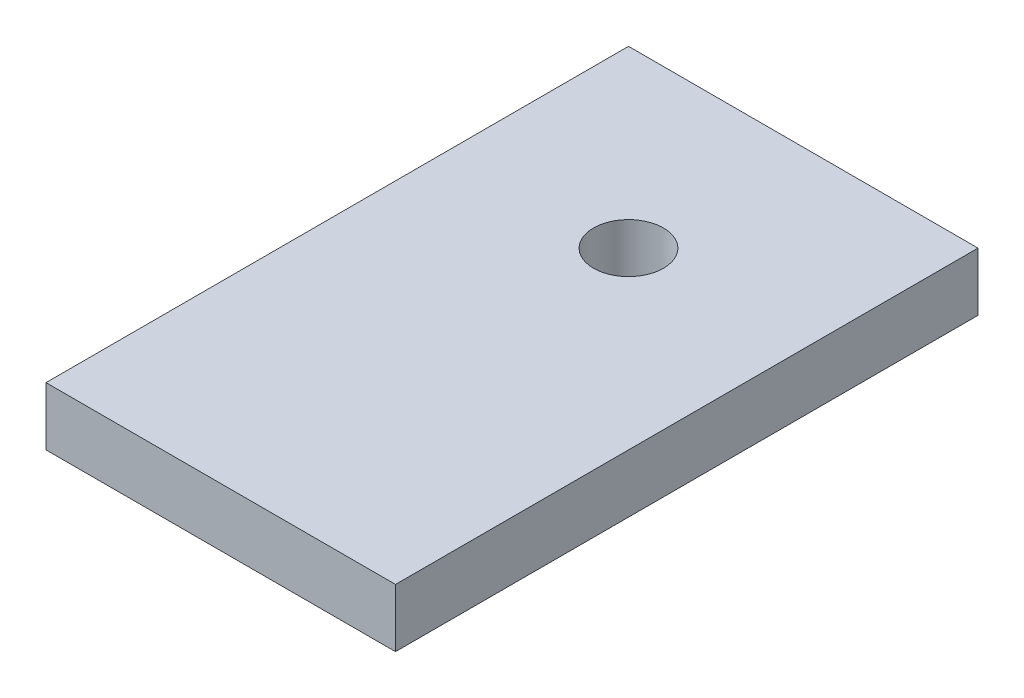
ISO-10303-21;
HEADER;
FILE_DESCRIPTION(('STEP AP214'),'2;1');
FILE_NAME('part.step','',(''),(''),'','','');
FILE_SCHEMA(('AUTOMOTIVE_DESIGN { 1 0 10303 214 1 1 1 1 }'));
ENDSEC;
DATA;
#1=APPLICATION_CONTEXT('core data for automotive mechanical design processes');
#2=APPLICATION_PROTOCOL_DEFINITION('international standard','automotive_design',2000,#1);
#3=PRODUCT_CONTEXT('',#1,'mechanical');
#4=PRODUCT('Part','Part','',(#3));
#5=PRODUCT_RELATED_PRODUCT_CATEGORY('part','',(#4));
#6=PRODUCT_DEFINITION_FORMATION('','',#4);
#7=PRODUCT_DEFINITION_CONTEXT('part definition',#1,'design');
#8=PRODUCT_DEFINITION('design','',#6,#7);
#9=PRODUCT_DEFINITION_SHAPE('','',#8);
#10=(LENGTH_UNIT() NAMED_UNIT(*) SI_UNIT(.MILLI.,.METRE.));
#11=(NAMED_UNIT(*) PLANE_ANGLE_UNIT() SI_UNIT($,.RADIAN.));
#12=(NAMED_UNIT(*) SI_UNIT($,.STERADIAN.) SOLID_ANGLE_UNIT());
#13=UNCERTAINTY_MEASURE_WITH_UNIT(LENGTH_MEASURE(1.E-05),#10,'distance_accuracy_value','');
#14=(GEOMETRIC_REPRESENTATION_CONTEXT(3) GLOBAL_UNCERTAINTY_ASSIGNED_CONTEXT((#13)) GLOBAL_UNIT_ASSIGNED_CONTEXT((#10,
#11,#12)) REPRESENTATION_CONTEXT('',''));
#15=CARTESIAN_POINT('',(0.,0.,0.));
#16=DIRECTION('',(0.,0.,1.));
#17=DIRECTION('',(1.,0.,0.));
#18=AXIS2_PLACEMENT_3D('',#15,#16,#17);
#19=CARTESIAN_POINT('',(-15.,5.,25.));
#20=DIRECTION('',(1.,0.,0.));
#21=DIRECTION('',(0.,0.,-1.));
#22=AXIS2_PLACEMENT_3D('',#19,#20,#21);
#23=PLANE('',#22);
#24=DIRECTION('',(0.,0.,1.));
#25=VECTOR('',#24,1.);
#26=CARTESIAN_POINT('',(-15.,0.,25.));
#27=LINE('',#26,#25);
#28=CARTESIAN_POINT('',(-15.,0.,-25.));
#29=VERTEX_POINT('',#28);
#30=CARTESIAN_POINT('',(-15.,0.,25.));
#31=VERTEX_POINT('',#30);
#32=EDGE_CURVE('E95',#29,#31,#27,.T.);
#33=ORIENTED_EDGE('',*,*,#32,.T.);
#34=DIRECTION('',(0.,-1.,0.));
#35=VECTOR('',#34,1.);
#36=CARTESIAN_POINT('',(-15.,5.,25.));
#37=LINE('',#36,#35);
#38=CARTESIAN_POINT('',(-15.,5.,25.));
#39=VERTEX_POINT('',#38);
#40=EDGE_CURVE('E11',#39,#31,#37,.T.);
#41=ORIENTED_EDGE('',*,*,#40,.F.);
#42=DIRECTION('',(0.,0.,1.));
#43=VECTOR('',#42,1.);
#44=CARTESIAN_POINT('',(-15.,5.,25.));
#45=LINE('',#44,#43);
#46=CARTESIAN_POINT('',(-15.,5.,-25.));
#47=VERTEX_POINT('',#46);
#48=EDGE_CURVE('E83',#47,#39,#45,.T.);
#49=ORIENTED_EDGE('',*,*,#48,.F.);
#50=DIRECTION('',(0.,-1.,0.));
#51=VECTOR('',#50,1.);
#52=CARTESIAN_POINT('',(-15.,5.,-25.));
#53=LINE('',#52,#51);
#54=EDGE_CURVE('E91',#47,#29,#53,.T.);
#55=ORIENTED_EDGE('',*,*,#54,.T.);
#56=EDGE_LOOP('',(#33,#41,#49,#55));
#57=FACE_BOUND('',#56,.T.);
#58=ADVANCED_FACE('F32',(#57),#23,.F.);
#59=CARTESIAN_POINT('',(15.,5.,25.));
#60=DIRECTION('',(0.,0.,-1.));
#61=DIRECTION('',(-1.,0.,0.));
#62=AXIS2_PLACEMENT_3D('',#59,#60,#61);
#63=PLANE('',#62);
#64=DIRECTION('',(1.,0.,0.));
#65=VECTOR('',#64,1.);
#66=CARTESIAN_POINT('',(15.,0.,25.));
#67=LINE('',#66,#65);
#68=CARTESIAN_POINT('',(15.,0.,25.));
#69=VERTEX_POINT('',#68);
#70=EDGE_CURVE('E87',#31,#69,#67,.T.);
#71=ORIENTED_EDGE('',*,*,#70,.T.);
#72=DIRECTION('',(0.,-1.,0.));
#73=VECTOR('',#72,1.);
#74=CARTESIAN_POINT('',(15.,5.,25.));
#75=LINE('',#74,#73);
#76=CARTESIAN_POINT('',(15.,5.,25.));
#77=VERTEX_POINT('',#76);
#78=EDGE_CURVE('E40',#77,#69,#75,.T.);
#79=ORIENTED_EDGE('',*,*,#78,.F.);
#80=DIRECTION('',(1.,0.,0.));
#81=VECTOR('',#80,1.);
#82=CARTESIAN_POINT('',(15.,5.,25.));
#83=LINE('',#82,#81);
#84=EDGE_CURVE('E78',#39,#77,#83,.T.);
#85=ORIENTED_EDGE('',*,*,#84,.F.);
#86=ORIENTED_EDGE('',*,*,#40,.T.);
#87=EDGE_LOOP('',(#71,#79,#85,#86));
#88=FACE_BOUND('',#87,.T.);
#89=ADVANCED_FACE('F86',(#88),#63,.F.);
#90=CARTESIAN_POINT('',(15.,5.,25.));
#91=DIRECTION('',(-1.,0.,0.));
#92=DIRECTION('',(0.,0.,1.));
#93=AXIS2_PLACEMENT_3D('',#90,#91,#92);
#94=PLANE('',#93);
#95=DIRECTION('',(0.,0.,-1.));
#96=VECTOR('',#95,1.);
#97=CARTESIAN_POINT('',(15.,0.,25.));
#98=LINE('',#97,#96);
#99=CARTESIAN_POINT('',(15.,0.,-25.));
#100=VERTEX_POINT('',#99);
#101=EDGE_CURVE('E65',#69,#100,#98,.T.);
#102=ORIENTED_EDGE('',*,*,#101,.T.);
#103=DIRECTION('',(0.,-1.,0.));
#104=VECTOR('',#103,1.);
#105=CARTESIAN_POINT('',(15.,5.,-25.));
#106=LINE('',#105,#104);
#107=CARTESIAN_POINT('',(15.,5.,-25.));
#108=VERTEX_POINT('',#107);
#109=EDGE_CURVE('E88',#108,#100,#106,.T.);
#110=ORIENTED_EDGE('',*,*,#109,.F.);
#111=DIRECTION('',(0.,0.,-1.));
#112=VECTOR('',#111,1.);
#113=CARTESIAN_POINT('',(15.,5.,25.));
#114=LINE('',#113,#112);
#115=EDGE_CURVE('E81',#77,#108,#114,.T.);
#116=ORIENTED_EDGE('',*,*,#115,.F.);
#117=ORIENTED_EDGE('',*,*,#78,.T.);
#118=EDGE_LOOP('',(#102,#110,#116,#117));
#119=FACE_BOUND('',#118,.T.);
#120=ADVANCED_FACE('F89',(#119),#94,.F.);
#121=CARTESIAN_POINT('',(15.,5.,-25.));
#122=DIRECTION('',(0.,0.,1.));
#123=DIRECTION('',(1.,0.,0.));
#124=AXIS2_PLACEMENT_3D('',#121,#122,#123);
#125=PLANE('',#124);
#126=DIRECTION('',(-1.,0.,0.));
#127=VECTOR('',#126,1.);
#128=CARTESIAN_POINT('',(15.,0.,-25.));
#129=LINE('',#128,#127);
#130=EDGE_CURVE('E71',#100,#29,#129,.T.);
#131=ORIENTED_EDGE('',*,*,#130,.T.);
#132=ORIENTED_EDGE('',*,*,#54,.F.);
#133=DIRECTION('',(-1.,0.,0.));
#134=VECTOR('',#133,1.);
#135=CARTESIAN_POINT('',(15.,5.,-25.));
#136=LINE('',#135,#134);
#137=EDGE_CURVE('E48',#108,#47,#136,.T.);
#138=ORIENTED_EDGE('',*,*,#137,.F.);
#139=ORIENTED_EDGE('',*,*,#109,.T.);
#140=EDGE_LOOP('',(#131,#132,#138,#139));
#141=FACE_BOUND('',#140,.T.);
#142=ADVANCED_FACE('F103',(#141),#125,.F.);
#143=CARTESIAN_POINT('',(0.,5.,0.));
#144=DIRECTION('',(0.,1.,0.));
#145=DIRECTION('',(0.,0.,1.));
#146=AXIS2_PLACEMENT_3D('',#143,#144,#145);
#147=PLANE('',#146);
#148=CARTESIAN_POINT('',(0.,5.,-10.));
#149=DIRECTION('',(0.,1.,0.));
#150=DIRECTION('',(0.,0.,1.));
#151=AXIS2_PLACEMENT_3D('',#148,#149,#150);
#152=CIRCLE('',#151,3.);
#153=CARTESIAN_POINT('',(0.,5.,-7.));
#154=VERTEX_POINT('',#153);
#155=EDGE_CURVE('E109',#154,#154,#152,.T.);
#156=ORIENTED_EDGE('',*,*,#155,.F.);
#157=EDGE_LOOP('',(#156));
#158=FACE_BOUND('',#157,.T.);
#159=ORIENTED_EDGE('',*,*,#48,.T.);
#160=ORIENTED_EDGE('',*,*,#84,.T.);
#161=ORIENTED_EDGE('',*,*,#115,.T.);
#162=ORIENTED_EDGE('',*,*,#137,.T.);
#163=EDGE_LOOP('',(#159,#160,#161,#162));
#164=FACE_BOUND('',#163,.T.);
#165=ADVANCED_FACE('F79',(#158,#164),#147,.T.);
#166=CARTESIAN_POINT('',(0.,0.,0.));
#167=DIRECTION('',(0.,1.,0.));
#168=DIRECTION('',(0.,0.,1.));
#169=AXIS2_PLACEMENT_3D('',#166,#167,#168);
#170=PLANE('',#169);
#171=CARTESIAN_POINT('',(0.,0.,-10.));
#172=DIRECTION('',(0.,1.,0.));
#173=DIRECTION('',(0.,0.,1.));
#174=AXIS2_PLACEMENT_3D('',#171,#172,#173);
#175=CIRCLE('',#174,3.);
#176=CARTESIAN_POINT('',(0.,0.,-7.));
#177=VERTEX_POINT('',#176);
#178=EDGE_CURVE('E98',#177,#177,#175,.T.);
#179=ORIENTED_EDGE('',*,*,#178,.T.);
#180=EDGE_LOOP('',(#179));
#181=FACE_BOUND('',#180,.T.);
#182=ORIENTED_EDGE('',*,*,#32,.F.);
#183=ORIENTED_EDGE('',*,*,#130,.F.);
#184=ORIENTED_EDGE('',*,*,#101,.F.);
#185=ORIENTED_EDGE('',*,*,#70,.F.);
#186=EDGE_LOOP('',(#182,#183,#184,#185));
#187=FACE_BOUND('',#186,.T.);
#188=ADVANCED_FACE('F106',(#181,#187),#170,.F.);
#189=CARTESIAN_POINT('',(0.,0.,-10.));
#190=DIRECTION('',(0.,1.,0.));
#191=DIRECTION('',(0.,0.,1.));
#192=AXIS2_PLACEMENT_3D('',#189,#190,#191);
#193=CYLINDRICAL_SURFACE('',#192,3.);
#194=ORIENTED_EDGE('',*,*,#178,.F.);
#195=EDGE_LOOP('',(#194));
#196=FACE_BOUND('',#195,.T.);
#197=ORIENTED_EDGE('',*,*,#155,.T.);
#198=EDGE_LOOP('',(#197));
#199=FACE_BOUND('',#198,.T.);
#200=ADVANCED_FACE('F116',(#196,#199),#193,.F.);
#201=CLOSED_SHELL('',(#58,#89,#120,#142,#165,#188,#200));
#202=MANIFOLD_SOLID_BREP('B2',#201);
#203=ADVANCED_BREP_SHAPE_REPRESENTATION('',(#18,#202),#14);
#204=SHAPE_DEFINITION_REPRESENTATION(#9,#203);
ENDSEC;
END-ISO-10303-21;
